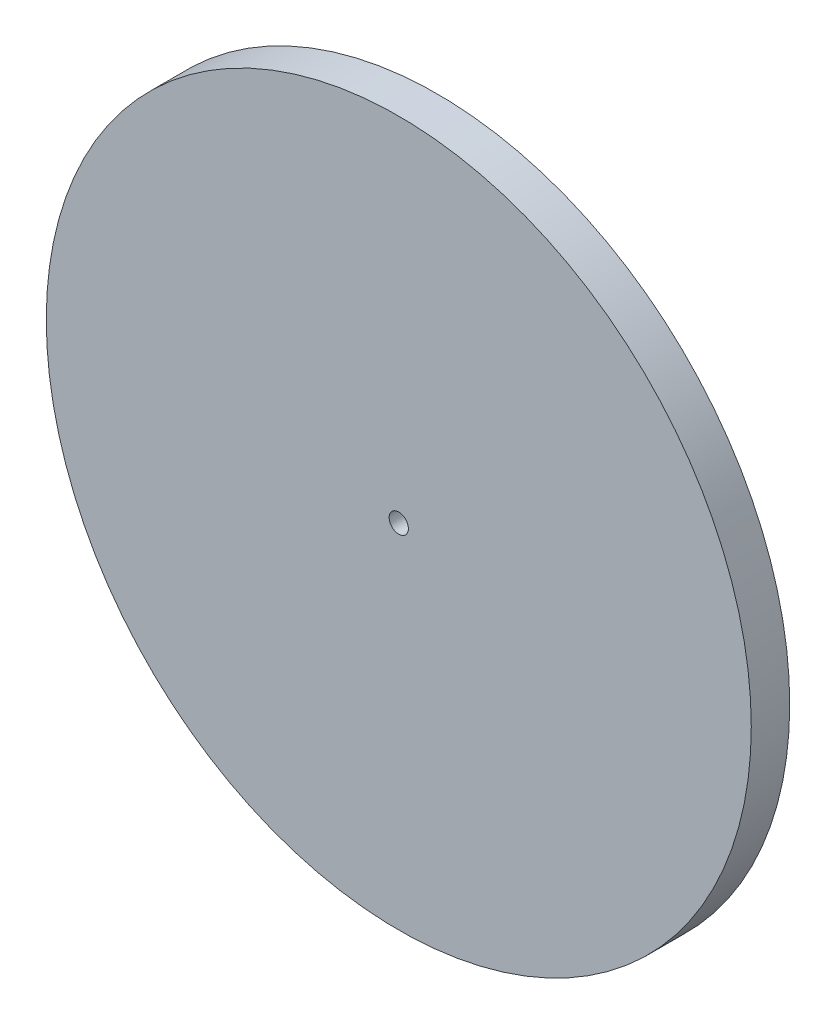
ISO-10303-21;
HEADER;
FILE_DESCRIPTION(('STEP AP214'),'2;1');
FILE_NAME('part.step','',(''),(''),'','','');
FILE_SCHEMA(('AUTOMOTIVE_DESIGN { 1 0 10303 214 1 1 1 1 }'));
ENDSEC;
DATA;
#1=APPLICATION_CONTEXT('core data for automotive mechanical design processes');
#2=APPLICATION_PROTOCOL_DEFINITION('international standard','automotive_design',2000,#1);
#3=PRODUCT_CONTEXT('',#1,'mechanical');
#4=PRODUCT('Part','Part','',(#3));
#5=PRODUCT_RELATED_PRODUCT_CATEGORY('part','',(#4));
#6=PRODUCT_DEFINITION_FORMATION('','',#4);
#7=PRODUCT_DEFINITION_CONTEXT('part definition',#1,'design');
#8=PRODUCT_DEFINITION('design','',#6,#7);
#9=PRODUCT_DEFINITION_SHAPE('','',#8);
#10=(LENGTH_UNIT() NAMED_UNIT(*) SI_UNIT(.MILLI.,.METRE.));
#11=(NAMED_UNIT(*) PLANE_ANGLE_UNIT() SI_UNIT($,.RADIAN.));
#12=(NAMED_UNIT(*) SI_UNIT($,.STERADIAN.) SOLID_ANGLE_UNIT());
#13=UNCERTAINTY_MEASURE_WITH_UNIT(LENGTH_MEASURE(1.E-05),#10,'distance_accuracy_value','');
#14=(GEOMETRIC_REPRESENTATION_CONTEXT(3) GLOBAL_UNCERTAINTY_ASSIGNED_CONTEXT((#13)) GLOBAL_UNIT_ASSIGNED_CONTEXT((#10,
#11,#12)) REPRESENTATION_CONTEXT('',''));
#15=CARTESIAN_POINT('',(0.,0.,0.));
#16=DIRECTION('',(0.,0.,1.));
#17=DIRECTION('',(1.,0.,0.));
#18=AXIS2_PLACEMENT_3D('',#15,#16,#17);
#19=CARTESIAN_POINT('',(0.,0.,3.));
#20=DIRECTION('',(0.,0.,1.));
#21=DIRECTION('',(1.,0.,0.));
#22=AXIS2_PLACEMENT_3D('',#19,#20,#21);
#23=PLANE('',#22);
#24=CARTESIAN_POINT('',(0.,0.,3.));
#25=DIRECTION('',(0.,0.,1.));
#26=DIRECTION('',(1.,0.,0.));
#27=AXIS2_PLACEMENT_3D('',#24,#25,#26);
#28=CIRCLE('',#27,27.5);
#29=CARTESIAN_POINT('',(27.5,0.,3.));
#30=VERTEX_POINT('',#29);
#31=EDGE_CURVE('E10',#30,#30,#28,.T.);
#32=ORIENTED_EDGE('',*,*,#31,.T.);
#33=EDGE_LOOP('',(#32));
#34=FACE_BOUND('',#33,.T.);
#35=CARTESIAN_POINT('',(0.,0.,3.));
#36=DIRECTION('',(0.,0.,1.));
#37=DIRECTION('',(1.,0.,0.));
#38=AXIS2_PLACEMENT_3D('',#35,#36,#37);
#39=CIRCLE('',#38,0.75);
#40=CARTESIAN_POINT('',(0.75,0.,3.));
#41=VERTEX_POINT('',#40);
#42=EDGE_CURVE('E50',#41,#41,#39,.T.);
#43=ORIENTED_EDGE('',*,*,#42,.F.);
#44=EDGE_LOOP('',(#43));
#45=FACE_BOUND('',#44,.T.);
#46=ADVANCED_FACE('F37',(#34,#45),#23,.T.);
#47=CARTESIAN_POINT('',(0.,0.,0.));
#48=DIRECTION('',(0.,0.,1.));
#49=DIRECTION('',(1.,0.,0.));
#50=AXIS2_PLACEMENT_3D('',#47,#48,#49);
#51=PLANE('',#50);
#52=CARTESIAN_POINT('',(0.,0.,0.));
#53=DIRECTION('',(0.,0.,1.));
#54=DIRECTION('',(1.,0.,0.));
#55=AXIS2_PLACEMENT_3D('',#52,#53,#54);
#56=CIRCLE('',#55,27.5);
#57=CARTESIAN_POINT('',(27.5,0.,0.));
#58=VERTEX_POINT('',#57);
#59=EDGE_CURVE('E41',#58,#58,#56,.T.);
#60=ORIENTED_EDGE('',*,*,#59,.F.);
#61=EDGE_LOOP('',(#60));
#62=FACE_BOUND('',#61,.T.);
#63=CARTESIAN_POINT('',(0.,0.,0.));
#64=DIRECTION('',(0.,0.,1.));
#65=DIRECTION('',(1.,0.,0.));
#66=AXIS2_PLACEMENT_3D('',#63,#64,#65);
#67=CIRCLE('',#66,0.75);
#68=CARTESIAN_POINT('',(0.75,0.,0.));
#69=VERTEX_POINT('',#68);
#70=EDGE_CURVE('E52',#69,#69,#67,.T.);
#71=ORIENTED_EDGE('',*,*,#70,.T.);
#72=EDGE_LOOP('',(#71));
#73=FACE_BOUND('',#72,.T.);
#74=ADVANCED_FACE('F64',(#62,#73),#51,.F.);
#75=CARTESIAN_POINT('',(0.,0.,3.));
#76=DIRECTION('',(0.,0.,-1.));
#77=DIRECTION('',(-1.,0.,0.));
#78=AXIS2_PLACEMENT_3D('',#75,#76,#77);
#79=CYLINDRICAL_SURFACE('',#78,27.5);
#80=ORIENTED_EDGE('',*,*,#31,.F.);
#81=EDGE_LOOP('',(#80));
#82=FACE_BOUND('',#81,.T.);
#83=ORIENTED_EDGE('',*,*,#59,.T.);
#84=EDGE_LOOP('',(#83));
#85=FACE_BOUND('',#84,.T.);
#86=ADVANCED_FACE('F39',(#82,#85),#79,.T.);
#87=CARTESIAN_POINT('',(0.,0.,3.));
#88=DIRECTION('',(0.,0.,-1.));
#89=DIRECTION('',(-1.,0.,0.));
#90=AXIS2_PLACEMENT_3D('',#87,#88,#89);
#91=CYLINDRICAL_SURFACE('',#90,0.75);
#92=ORIENTED_EDGE('',*,*,#42,.T.);
#93=EDGE_LOOP('',(#92));
#94=FACE_BOUND('',#93,.T.);
#95=ORIENTED_EDGE('',*,*,#70,.F.);
#96=EDGE_LOOP('',(#95));
#97=FACE_BOUND('',#96,.T.);
#98=ADVANCED_FACE('F60',(#94,#97),#91,.F.);
#99=CLOSED_SHELL('',(#46,#74,#86,#98));
#100=MANIFOLD_SOLID_BREP('B2',#99);
#101=ADVANCED_BREP_SHAPE_REPRESENTATION('',(#18,#100),#14);
#102=SHAPE_DEFINITION_REPRESENTATION(#9,#101);
ENDSEC;
END-ISO-10303-21;
